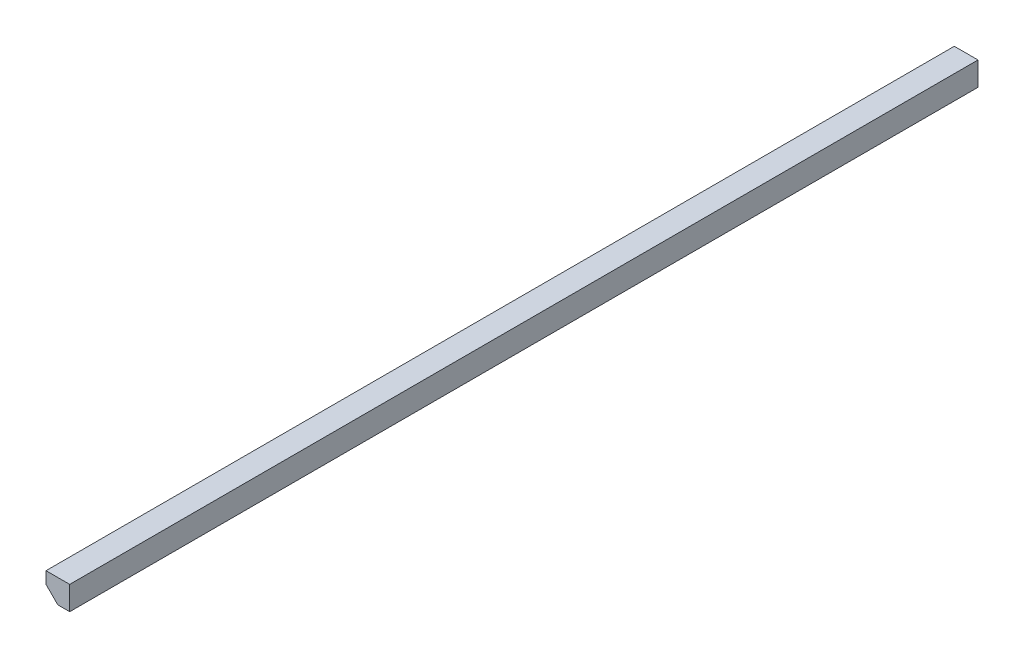
ISO-10303-21;
HEADER;
FILE_DESCRIPTION(('STEP AP214'),'2;1');
FILE_NAME('part.step','',(''),(''),'','','');
FILE_SCHEMA(('AUTOMOTIVE_DESIGN { 1 0 10303 214 1 1 1 1 }'));
ENDSEC;
DATA;
#1=APPLICATION_CONTEXT('core data for automotive mechanical design processes');
#2=APPLICATION_PROTOCOL_DEFINITION('international standard','automotive_design',2000,#1);
#3=PRODUCT_CONTEXT('',#1,'mechanical');
#4=PRODUCT('Part','Part','',(#3));
#5=PRODUCT_RELATED_PRODUCT_CATEGORY('part','',(#4));
#6=PRODUCT_DEFINITION_FORMATION('','',#4);
#7=PRODUCT_DEFINITION_CONTEXT('part definition',#1,'design');
#8=PRODUCT_DEFINITION('design','',#6,#7);
#9=PRODUCT_DEFINITION_SHAPE('','',#8);
#10=(LENGTH_UNIT() NAMED_UNIT(*) SI_UNIT(.MILLI.,.METRE.));
#11=(NAMED_UNIT(*) PLANE_ANGLE_UNIT() SI_UNIT($,.RADIAN.));
#12=(NAMED_UNIT(*) SI_UNIT($,.STERADIAN.) SOLID_ANGLE_UNIT());
#13=UNCERTAINTY_MEASURE_WITH_UNIT(LENGTH_MEASURE(1.E-05),#10,'distance_accuracy_value','');
#14=(GEOMETRIC_REPRESENTATION_CONTEXT(3) GLOBAL_UNCERTAINTY_ASSIGNED_CONTEXT((#13)) GLOBAL_UNIT_ASSIGNED_CONTEXT((#10,
#11,#12)) REPRESENTATION_CONTEXT('',''));
#15=CARTESIAN_POINT('',(0.,0.,0.));
#16=DIRECTION('',(0.,0.,1.));
#17=DIRECTION('',(1.,0.,0.));
#18=AXIS2_PLACEMENT_3D('',#15,#16,#17);
#19=CARTESIAN_POINT('',(9.525,0.,365.125));
#20=DIRECTION('',(0.,1.,0.));
#21=DIRECTION('',(0.,0.,1.));
#22=AXIS2_PLACEMENT_3D('',#19,#20,#21);
#23=PLANE('',#22);
#24=DIRECTION('',(1.,0.,0.));
#25=VECTOR('',#24,1.);
#26=CARTESIAN_POINT('',(9.525,0.,-365.125));
#27=LINE('',#26,#25);
#28=CARTESIAN_POINT('',(9.525,0.,-365.125));
#29=VERTEX_POINT('',#28);
#30=CARTESIAN_POINT('',(19.05,0.,-365.125));
#31=VERTEX_POINT('',#30);
#32=EDGE_CURVE('E105',#29,#31,#27,.T.);
#33=ORIENTED_EDGE('',*,*,#32,.T.);
#34=DIRECTION('',(0.,0.,-1.));
#35=VECTOR('',#34,1.);
#36=CARTESIAN_POINT('',(19.05,0.,365.125));
#37=LINE('',#36,#35);
#38=CARTESIAN_POINT('',(19.05,0.,365.125));
#39=VERTEX_POINT('',#38);
#40=EDGE_CURVE('E11',#39,#31,#37,.T.);
#41=ORIENTED_EDGE('',*,*,#40,.F.);
#42=DIRECTION('',(1.,0.,0.));
#43=VECTOR('',#42,1.);
#44=CARTESIAN_POINT('',(9.525,0.,365.125));
#45=LINE('',#44,#43);
#46=CARTESIAN_POINT('',(9.525,0.,365.125));
#47=VERTEX_POINT('',#46);
#48=EDGE_CURVE('E113',#47,#39,#45,.T.);
#49=ORIENTED_EDGE('',*,*,#48,.F.);
#50=DIRECTION('',(0.,0.,-1.));
#51=VECTOR('',#50,1.);
#52=CARTESIAN_POINT('',(9.525,0.,365.125));
#53=LINE('',#52,#51);
#54=EDGE_CURVE('E101',#47,#29,#53,.T.);
#55=ORIENTED_EDGE('',*,*,#54,.T.);
#56=EDGE_LOOP('',(#33,#41,#49,#55));
#57=FACE_BOUND('',#56,.T.);
#58=ADVANCED_FACE('F31',(#57),#23,.F.);
#59=CARTESIAN_POINT('',(19.05,0.,365.125));
#60=DIRECTION('',(-1.,0.,0.));
#61=DIRECTION('',(0.,0.,1.));
#62=AXIS2_PLACEMENT_3D('',#59,#60,#61);
#63=PLANE('',#62);
#64=DIRECTION('',(0.,1.,0.));
#65=VECTOR('',#64,1.);
#66=CARTESIAN_POINT('',(19.05,0.,-365.125));
#67=LINE('',#66,#65);
#68=CARTESIAN_POINT('',(19.05,19.05,-365.125));
#69=VERTEX_POINT('',#68);
#70=EDGE_CURVE('E108',#31,#69,#67,.T.);
#71=ORIENTED_EDGE('',*,*,#70,.T.);
#72=DIRECTION('',(0.,0.,-1.));
#73=VECTOR('',#72,1.);
#74=CARTESIAN_POINT('',(19.05,19.05,365.125));
#75=LINE('',#74,#73);
#76=CARTESIAN_POINT('',(19.05,19.05,365.125));
#77=VERTEX_POINT('',#76);
#78=EDGE_CURVE('E39',#77,#69,#75,.T.);
#79=ORIENTED_EDGE('',*,*,#78,.F.);
#80=DIRECTION('',(0.,1.,0.));
#81=VECTOR('',#80,1.);
#82=CARTESIAN_POINT('',(19.05,0.,365.125));
#83=LINE('',#82,#81);
#84=EDGE_CURVE('E81',#39,#77,#83,.T.);
#85=ORIENTED_EDGE('',*,*,#84,.F.);
#86=ORIENTED_EDGE('',*,*,#40,.T.);
#87=EDGE_LOOP('',(#71,#79,#85,#86));
#88=FACE_BOUND('',#87,.T.);
#89=ADVANCED_FACE('F132',(#88),#63,.F.);
#90=CARTESIAN_POINT('',(19.05,19.05,365.125));
#91=DIRECTION('',(0.,-1.,0.));
#92=DIRECTION('',(0.,0.,-1.));
#93=AXIS2_PLACEMENT_3D('',#90,#91,#92);
#94=PLANE('',#93);
#95=DIRECTION('',(-1.,0.,0.));
#96=VECTOR('',#95,1.);
#97=CARTESIAN_POINT('',(19.05,19.05,-365.125));
#98=LINE('',#97,#96);
#99=CARTESIAN_POINT('',(0.,19.05,-365.125));
#100=VERTEX_POINT('',#99);
#101=EDGE_CURVE('E96',#69,#100,#98,.T.);
#102=ORIENTED_EDGE('',*,*,#101,.T.);
#103=DIRECTION('',(0.,0.,-1.));
#104=VECTOR('',#103,1.);
#105=CARTESIAN_POINT('',(0.,19.05,365.125));
#106=LINE('',#105,#104);
#107=CARTESIAN_POINT('',(0.,19.05,365.125));
#108=VERTEX_POINT('',#107);
#109=EDGE_CURVE('E93',#108,#100,#106,.T.);
#110=ORIENTED_EDGE('',*,*,#109,.F.);
#111=DIRECTION('',(-1.,0.,0.));
#112=VECTOR('',#111,1.);
#113=CARTESIAN_POINT('',(19.05,19.05,365.125));
#114=LINE('',#113,#112);
#115=EDGE_CURVE('E85',#77,#108,#114,.T.);
#116=ORIENTED_EDGE('',*,*,#115,.F.);
#117=ORIENTED_EDGE('',*,*,#78,.T.);
#118=EDGE_LOOP('',(#102,#110,#116,#117));
#119=FACE_BOUND('',#118,.T.);
#120=ADVANCED_FACE('F94',(#119),#94,.F.);
#121=CARTESIAN_POINT('',(0.,19.05,365.125));
#122=DIRECTION('',(1.,0.,0.));
#123=DIRECTION('',(0.,0.,-1.));
#124=AXIS2_PLACEMENT_3D('',#121,#122,#123);
#125=PLANE('',#124);
#126=DIRECTION('',(0.,-1.,0.));
#127=VECTOR('',#126,1.);
#128=CARTESIAN_POINT('',(0.,19.05,-365.125));
#129=LINE('',#128,#127);
#130=CARTESIAN_POINT('',(0.,9.525,-365.125));
#131=VERTEX_POINT('',#130);
#132=EDGE_CURVE('E67',#100,#131,#129,.T.);
#133=ORIENTED_EDGE('',*,*,#132,.T.);
#134=DIRECTION('',(0.,0.,-1.));
#135=VECTOR('',#134,1.);
#136=CARTESIAN_POINT('',(0.,9.525,365.125));
#137=LINE('',#136,#135);
#138=CARTESIAN_POINT('',(0.,9.525,365.125));
#139=VERTEX_POINT('',#138);
#140=EDGE_CURVE('E97',#139,#131,#137,.T.);
#141=ORIENTED_EDGE('',*,*,#140,.F.);
#142=DIRECTION('',(0.,-1.,0.));
#143=VECTOR('',#142,1.);
#144=CARTESIAN_POINT('',(0.,19.05,365.125));
#145=LINE('',#144,#143);
#146=EDGE_CURVE('E89',#108,#139,#145,.T.);
#147=ORIENTED_EDGE('',*,*,#146,.F.);
#148=ORIENTED_EDGE('',*,*,#109,.T.);
#149=EDGE_LOOP('',(#133,#141,#147,#148));
#150=FACE_BOUND('',#149,.T.);
#151=ADVANCED_FACE('F99',(#150),#125,.F.);
#152=CARTESIAN_POINT('',(0.,9.525,365.125));
#153=DIRECTION('',(0.707106781186548,0.707106781186547,0.));
#154=DIRECTION('',(-0.707106781186547,0.707106781186548,0.));
#155=AXIS2_PLACEMENT_3D('',#152,#153,#154);
#156=PLANE('',#155);
#157=DIRECTION('',(0.707106781186547,-0.707106781186548,0.));
#158=VECTOR('',#157,1.);
#159=CARTESIAN_POINT('',(0.,9.525,-365.125));
#160=LINE('',#159,#158);
#161=EDGE_CURVE('E73',#131,#29,#160,.T.);
#162=ORIENTED_EDGE('',*,*,#161,.T.);
#163=ORIENTED_EDGE('',*,*,#54,.F.);
#164=DIRECTION('',(0.707106781186547,-0.707106781186548,0.));
#165=VECTOR('',#164,1.);
#166=CARTESIAN_POINT('',(0.,9.525,365.125));
#167=LINE('',#166,#165);
#168=EDGE_CURVE('E47',#139,#47,#167,.T.);
#169=ORIENTED_EDGE('',*,*,#168,.F.);
#170=ORIENTED_EDGE('',*,*,#140,.T.);
#171=EDGE_LOOP('',(#162,#163,#169,#170));
#172=FACE_BOUND('',#171,.T.);
#173=ADVANCED_FACE('F121',(#172),#156,.F.);
#174=CARTESIAN_POINT('',(19.05,0.,365.125));
#175=DIRECTION('',(0.,0.,1.));
#176=DIRECTION('',(1.,0.,0.));
#177=AXIS2_PLACEMENT_3D('',#174,#175,#176);
#178=PLANE('',#177);
#179=ORIENTED_EDGE('',*,*,#48,.T.);
#180=ORIENTED_EDGE('',*,*,#84,.T.);
#181=ORIENTED_EDGE('',*,*,#115,.T.);
#182=ORIENTED_EDGE('',*,*,#146,.T.);
#183=ORIENTED_EDGE('',*,*,#168,.T.);
#184=EDGE_LOOP('',(#179,#180,#181,#182,#183));
#185=FACE_BOUND('',#184,.T.);
#186=ADVANCED_FACE('F87',(#185),#178,.T.);
#187=CARTESIAN_POINT('',(19.05,0.,-365.125));
#188=DIRECTION('',(0.,0.,1.));
#189=DIRECTION('',(1.,0.,0.));
#190=AXIS2_PLACEMENT_3D('',#187,#188,#189);
#191=PLANE('',#190);
#192=ORIENTED_EDGE('',*,*,#32,.F.);
#193=ORIENTED_EDGE('',*,*,#161,.F.);
#194=ORIENTED_EDGE('',*,*,#132,.F.);
#195=ORIENTED_EDGE('',*,*,#101,.F.);
#196=ORIENTED_EDGE('',*,*,#70,.F.);
#197=EDGE_LOOP('',(#192,#193,#194,#195,#196));
#198=FACE_BOUND('',#197,.T.);
#199=ADVANCED_FACE('F117',(#198),#191,.F.);
#200=CLOSED_SHELL('',(#58,#89,#120,#151,#173,#186,#199));
#201=MANIFOLD_SOLID_BREP('B2',#200);
#202=ADVANCED_BREP_SHAPE_REPRESENTATION('',(#18,#201),#14);
#203=SHAPE_DEFINITION_REPRESENTATION(#9,#202);
ENDSEC;
END-ISO-10303-21;
